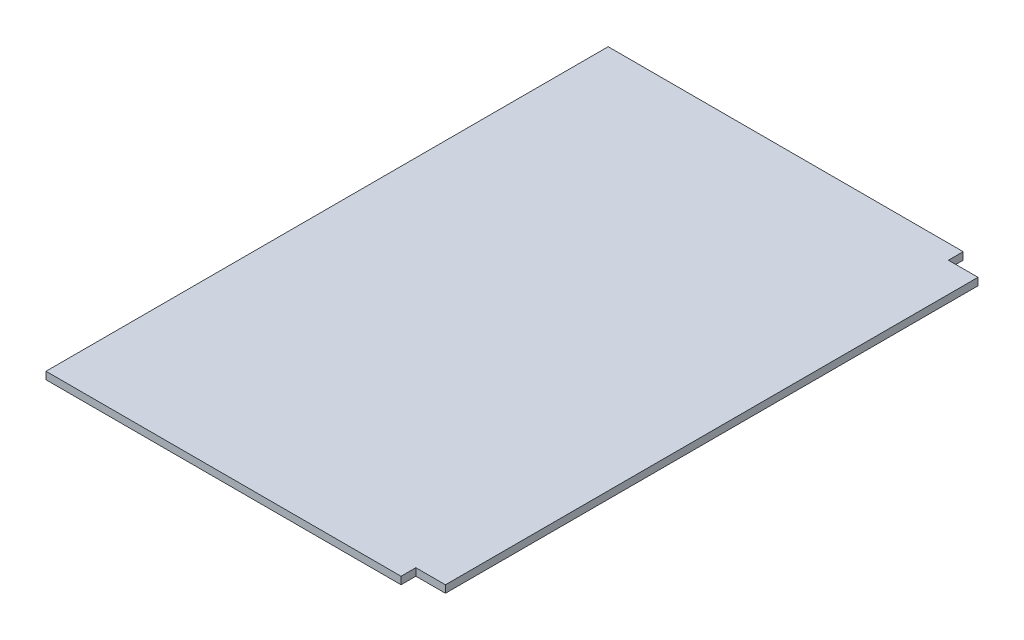
ISO-10303-21;
HEADER;
FILE_DESCRIPTION(('STEP AP214'),'2;1');
FILE_NAME('part.step','',(''),(''),'','','');
FILE_SCHEMA(('AUTOMOTIVE_DESIGN { 1 0 10303 214 1 1 1 1 }'));
ENDSEC;
DATA;
#1=APPLICATION_CONTEXT('core data for automotive mechanical design processes');
#2=APPLICATION_PROTOCOL_DEFINITION('international standard','automotive_design',2000,#1);
#3=PRODUCT_CONTEXT('',#1,'mechanical');
#4=PRODUCT('Part','Part','',(#3));
#5=PRODUCT_RELATED_PRODUCT_CATEGORY('part','',(#4));
#6=PRODUCT_DEFINITION_FORMATION('','',#4);
#7=PRODUCT_DEFINITION_CONTEXT('part definition',#1,'design');
#8=PRODUCT_DEFINITION('design','',#6,#7);
#9=PRODUCT_DEFINITION_SHAPE('','',#8);
#10=(LENGTH_UNIT() NAMED_UNIT(*) SI_UNIT(.MILLI.,.METRE.));
#11=(NAMED_UNIT(*) PLANE_ANGLE_UNIT() SI_UNIT($,.RADIAN.));
#12=(NAMED_UNIT(*) SI_UNIT($,.STERADIAN.) SOLID_ANGLE_UNIT());
#13=UNCERTAINTY_MEASURE_WITH_UNIT(LENGTH_MEASURE(1.E-05),#10,'distance_accuracy_value','');
#14=(GEOMETRIC_REPRESENTATION_CONTEXT(3) GLOBAL_UNCERTAINTY_ASSIGNED_CONTEXT((#13)) GLOBAL_UNIT_ASSIGNED_CONTEXT((#10,
#11,#12)) REPRESENTATION_CONTEXT('',''));
#15=CARTESIAN_POINT('',(0.,0.,0.));
#16=DIRECTION('',(0.,0.,1.));
#17=DIRECTION('',(1.,0.,0.));
#18=AXIS2_PLACEMENT_3D('',#15,#16,#17);
#19=CARTESIAN_POINT('',(-457.2,-12.7,609.6));
#20=DIRECTION('',(0.,0.,1.));
#21=DIRECTION('',(1.,0.,0.));
#22=AXIS2_PLACEMENT_3D('',#19,#20,#21);
#23=PLANE('',#22);
#24=DIRECTION('',(0.,1.,0.));
#25=VECTOR('',#24,1.);
#26=CARTESIAN_POINT('',(152.4,-69.4961266284947,609.6));
#27=LINE('',#26,#25);
#28=CARTESIAN_POINT('',(152.4,-12.7,609.6));
#29=VERTEX_POINT('',#28);
#30=CARTESIAN_POINT('',(152.4,0.,609.6));
#31=VERTEX_POINT('',#30);
#32=EDGE_CURVE('E148',#29,#31,#27,.T.);
#33=ORIENTED_EDGE('',*,*,#32,.T.);
#34=DIRECTION('',(1.,0.,0.));
#35=VECTOR('',#34,1.);
#36=CARTESIAN_POINT('',(-457.2,0.,609.6));
#37=LINE('',#36,#35);
#38=CARTESIAN_POINT('',(-457.2,0.,609.6));
#39=VERTEX_POINT('',#38);
#40=EDGE_CURVE('E135',#39,#31,#37,.T.);
#41=ORIENTED_EDGE('',*,*,#40,.F.);
#42=DIRECTION('',(0.,1.,0.));
#43=VECTOR('',#42,1.);
#44=CARTESIAN_POINT('',(-457.2,-12.7,609.6));
#45=LINE('',#44,#43);
#46=CARTESIAN_POINT('',(-457.2,-12.7,609.6));
#47=VERTEX_POINT('',#46);
#48=EDGE_CURVE('E11',#47,#39,#45,.T.);
#49=ORIENTED_EDGE('',*,*,#48,.F.);
#50=DIRECTION('',(1.,0.,0.));
#51=VECTOR('',#50,1.);
#52=CARTESIAN_POINT('',(-457.2,-12.7,609.6));
#53=LINE('',#52,#51);
#54=EDGE_CURVE('E42',#47,#29,#53,.T.);
#55=ORIENTED_EDGE('',*,*,#54,.T.);
#56=EDGE_LOOP('',(#33,#41,#49,#55));
#57=FACE_BOUND('',#56,.T.);
#58=ADVANCED_FACE('F34',(#57),#23,.T.);
#59=CARTESIAN_POINT('',(0.,-12.7,0.));
#60=DIRECTION('',(0.,1.,0.));
#61=DIRECTION('',(0.,0.,1.));
#62=AXIS2_PLACEMENT_3D('',#59,#60,#61);
#63=PLANE('',#62);
#64=DIRECTION('',(0.,0.,-1.));
#65=VECTOR('',#64,1.);
#66=CARTESIAN_POINT('',(152.4,-12.7,-355.6));
#67=LINE('',#66,#65);
#68=CARTESIAN_POINT('',(152.4,-12.7,-330.2));
#69=VERTEX_POINT('',#68);
#70=CARTESIAN_POINT('',(152.4,-12.6999999999999,-355.6));
#71=VERTEX_POINT('',#70);
#72=EDGE_CURVE('E57',#69,#71,#67,.T.);
#73=ORIENTED_EDGE('',*,*,#72,.F.);
#74=DIRECTION('',(-1.,0.,0.));
#75=VECTOR('',#74,1.);
#76=CARTESIAN_POINT('',(203.2,-12.7,-330.2));
#77=LINE('',#76,#75);
#78=CARTESIAN_POINT('',(203.2,-12.7,-330.2));
#79=VERTEX_POINT('',#78);
#80=EDGE_CURVE('E121',#79,#69,#77,.T.);
#81=ORIENTED_EDGE('',*,*,#80,.F.);
#82=DIRECTION('',(0.,0.,1.));
#83=VECTOR('',#82,1.);
#84=CARTESIAN_POINT('',(203.2,-12.6999999999999,0.));
#85=LINE('',#84,#83);
#86=CARTESIAN_POINT('',(203.2,-12.6999999999999,584.2));
#87=VERTEX_POINT('',#86);
#88=EDGE_CURVE('E130',#79,#87,#85,.T.);
#89=ORIENTED_EDGE('',*,*,#88,.T.);
#90=DIRECTION('',(1.,0.,0.));
#91=VECTOR('',#90,1.);
#92=CARTESIAN_POINT('',(203.2,-12.7,584.2));
#93=LINE('',#92,#91);
#94=CARTESIAN_POINT('',(152.4,-12.7,584.2));
#95=VERTEX_POINT('',#94);
#96=EDGE_CURVE('E49',#95,#87,#93,.T.);
#97=ORIENTED_EDGE('',*,*,#96,.F.);
#98=DIRECTION('',(0.,0.,-1.));
#99=VECTOR('',#98,1.);
#100=CARTESIAN_POINT('',(152.4,-12.7,609.6));
#101=LINE('',#100,#99);
#102=EDGE_CURVE('E151',#29,#95,#101,.T.);
#103=ORIENTED_EDGE('',*,*,#102,.F.);
#104=ORIENTED_EDGE('',*,*,#54,.F.);
#105=DIRECTION('',(0.,0.,1.));
#106=VECTOR('',#105,1.);
#107=CARTESIAN_POINT('',(-457.2,-12.7,-609.6));
#108=LINE('',#107,#106);
#109=CARTESIAN_POINT('',(-457.2,-12.6999999999999,-355.6));
#110=VERTEX_POINT('',#109);
#111=EDGE_CURVE('E133',#110,#47,#108,.T.);
#112=ORIENTED_EDGE('',*,*,#111,.F.);
#113=DIRECTION('',(-1.,0.,0.));
#114=VECTOR('',#113,1.);
#115=CARTESIAN_POINT('',(0.,-12.6999999999999,-355.6));
#116=LINE('',#115,#114);
#117=EDGE_CURVE('E126',#71,#110,#116,.T.);
#118=ORIENTED_EDGE('',*,*,#117,.F.);
#119=EDGE_LOOP('',(#73,#81,#89,#97,#103,#104,#112,#118));
#120=FACE_BOUND('',#119,.T.);
#121=ADVANCED_FACE('F176',(#120),#63,.F.);
#122=CARTESIAN_POINT('',(0.,0.,0.));
#123=DIRECTION('',(0.,1.,0.));
#124=DIRECTION('',(0.,0.,1.));
#125=AXIS2_PLACEMENT_3D('',#122,#123,#124);
#126=PLANE('',#125);
#127=DIRECTION('',(1.,0.,0.));
#128=VECTOR('',#127,1.);
#129=CARTESIAN_POINT('',(203.2,0.,-330.2));
#130=LINE('',#129,#128);
#131=CARTESIAN_POINT('',(152.4,0.,-330.2));
#132=VERTEX_POINT('',#131);
#133=CARTESIAN_POINT('',(203.2,0.,-330.2));
#134=VERTEX_POINT('',#133);
#135=EDGE_CURVE('E108',#132,#134,#130,.T.);
#136=ORIENTED_EDGE('',*,*,#135,.F.);
#137=DIRECTION('',(0.,0.,1.));
#138=VECTOR('',#137,1.);
#139=CARTESIAN_POINT('',(152.4,0.,-355.6));
#140=LINE('',#139,#138);
#141=CARTESIAN_POINT('',(152.4,0.,-355.6));
#142=VERTEX_POINT('',#141);
#143=EDGE_CURVE('E102',#142,#132,#140,.T.);
#144=ORIENTED_EDGE('',*,*,#143,.F.);
#145=DIRECTION('',(1.,0.,0.));
#146=VECTOR('',#145,1.);
#147=CARTESIAN_POINT('',(0.,0.,-355.6));
#148=LINE('',#147,#146);
#149=CARTESIAN_POINT('',(-457.2,0.,-355.6));
#150=VERTEX_POINT('',#149);
#151=EDGE_CURVE('E113',#150,#142,#148,.T.);
#152=ORIENTED_EDGE('',*,*,#151,.F.);
#153=DIRECTION('',(0.,0.,1.));
#154=VECTOR('',#153,1.);
#155=CARTESIAN_POINT('',(-457.2,0.,-609.6));
#156=LINE('',#155,#154);
#157=EDGE_CURVE('E138',#150,#39,#156,.T.);
#158=ORIENTED_EDGE('',*,*,#157,.T.);
#159=ORIENTED_EDGE('',*,*,#40,.T.);
#160=DIRECTION('',(0.,0.,1.));
#161=VECTOR('',#160,1.);
#162=CARTESIAN_POINT('',(152.4,0.,609.6));
#163=LINE('',#162,#161);
#164=CARTESIAN_POINT('',(152.4,0.,584.2));
#165=VERTEX_POINT('',#164);
#166=EDGE_CURVE('E143',#165,#31,#163,.T.);
#167=ORIENTED_EDGE('',*,*,#166,.F.);
#168=DIRECTION('',(-1.,0.,0.));
#169=VECTOR('',#168,1.);
#170=CARTESIAN_POINT('',(203.2,0.,584.2));
#171=LINE('',#170,#169);
#172=CARTESIAN_POINT('',(203.2,0.,584.2));
#173=VERTEX_POINT('',#172);
#174=EDGE_CURVE('E161',#173,#165,#171,.T.);
#175=ORIENTED_EDGE('',*,*,#174,.F.);
#176=DIRECTION('',(0.,0.,-1.));
#177=VECTOR('',#176,1.);
#178=CARTESIAN_POINT('',(203.2,0.,0.));
#179=LINE('',#178,#177);
#180=EDGE_CURVE('E120',#173,#134,#179,.T.);
#181=ORIENTED_EDGE('',*,*,#180,.T.);
#182=EDGE_LOOP('',(#136,#144,#152,#158,#159,#167,#175,#181));
#183=FACE_BOUND('',#182,.T.);
#184=ADVANCED_FACE('F112',(#183),#126,.T.);
#185=CARTESIAN_POINT('',(-457.2,-12.7,-609.6));
#186=DIRECTION('',(-1.,0.,0.));
#187=DIRECTION('',(0.,0.,1.));
#188=AXIS2_PLACEMENT_3D('',#185,#186,#187);
#189=PLANE('',#188);
#190=DIRECTION('',(0.,1.,0.));
#191=VECTOR('',#190,1.);
#192=CARTESIAN_POINT('',(-457.2,-1536.7,-355.6));
#193=LINE('',#192,#191);
#194=EDGE_CURVE('E119',#110,#150,#193,.T.);
#195=ORIENTED_EDGE('',*,*,#194,.F.);
#196=ORIENTED_EDGE('',*,*,#111,.T.);
#197=ORIENTED_EDGE('',*,*,#48,.T.);
#198=ORIENTED_EDGE('',*,*,#157,.F.);
#199=EDGE_LOOP('',(#195,#196,#197,#198));
#200=FACE_BOUND('',#199,.T.);
#201=ADVANCED_FACE('F36',(#200),#189,.T.);
#202=CARTESIAN_POINT('',(203.2,-1536.7,0.));
#203=DIRECTION('',(1.,0.,0.));
#204=DIRECTION('',(0.,0.,-1.));
#205=AXIS2_PLACEMENT_3D('',#202,#203,#204);
#206=PLANE('',#205);
#207=DIRECTION('',(0.,1.,0.));
#208=VECTOR('',#207,1.);
#209=CARTESIAN_POINT('',(203.2,-69.4961266284947,-330.2));
#210=LINE('',#209,#208);
#211=EDGE_CURVE('E164',#79,#134,#210,.T.);
#212=ORIENTED_EDGE('',*,*,#211,.T.);
#213=ORIENTED_EDGE('',*,*,#180,.F.);
#214=DIRECTION('',(0.,1.,0.));
#215=VECTOR('',#214,1.);
#216=CARTESIAN_POINT('',(203.2,-69.4961266284947,584.2));
#217=LINE('',#216,#215);
#218=EDGE_CURVE('E155',#87,#173,#217,.T.);
#219=ORIENTED_EDGE('',*,*,#218,.F.);
#220=ORIENTED_EDGE('',*,*,#88,.F.);
#221=EDGE_LOOP('',(#212,#213,#219,#220));
#222=FACE_BOUND('',#221,.T.);
#223=ADVANCED_FACE('F174',(#222),#206,.T.);
#224=CARTESIAN_POINT('',(0.,-1536.7,-355.6));
#225=DIRECTION('',(0.,0.,1.));
#226=DIRECTION('',(1.,0.,0.));
#227=AXIS2_PLACEMENT_3D('',#224,#225,#226);
#228=PLANE('',#227);
#229=ORIENTED_EDGE('',*,*,#151,.T.);
#230=DIRECTION('',(0.,1.,0.));
#231=VECTOR('',#230,1.);
#232=CARTESIAN_POINT('',(152.4,-69.4961266284947,-355.6));
#233=LINE('',#232,#231);
#234=EDGE_CURVE('E99',#71,#142,#233,.T.);
#235=ORIENTED_EDGE('',*,*,#234,.F.);
#236=ORIENTED_EDGE('',*,*,#117,.T.);
#237=ORIENTED_EDGE('',*,*,#194,.T.);
#238=EDGE_LOOP('',(#229,#235,#236,#237));
#239=FACE_BOUND('',#238,.T.);
#240=ADVANCED_FACE('F117',(#239),#228,.F.);
#241=CARTESIAN_POINT('',(203.2,-69.4961266284947,-330.2));
#242=DIRECTION('',(0.,0.,1.));
#243=DIRECTION('',(1.,0.,0.));
#244=AXIS2_PLACEMENT_3D('',#241,#242,#243);
#245=PLANE('',#244);
#246=ORIENTED_EDGE('',*,*,#80,.T.);
#247=DIRECTION('',(0.,1.,0.));
#248=VECTOR('',#247,1.);
#249=CARTESIAN_POINT('',(152.4,-69.4961266284947,-330.2));
#250=LINE('',#249,#248);
#251=EDGE_CURVE('E107',#69,#132,#250,.T.);
#252=ORIENTED_EDGE('',*,*,#251,.T.);
#253=ORIENTED_EDGE('',*,*,#135,.T.);
#254=ORIENTED_EDGE('',*,*,#211,.F.);
#255=EDGE_LOOP('',(#246,#252,#253,#254));
#256=FACE_BOUND('',#255,.T.);
#257=ADVANCED_FACE('F169',(#256),#245,.F.);
#258=CARTESIAN_POINT('',(152.4,-69.4961266284947,-355.6));
#259=DIRECTION('',(-1.,0.,0.));
#260=DIRECTION('',(0.,0.,1.));
#261=AXIS2_PLACEMENT_3D('',#258,#259,#260);
#262=PLANE('',#261);
#263=ORIENTED_EDGE('',*,*,#72,.T.);
#264=ORIENTED_EDGE('',*,*,#234,.T.);
#265=ORIENTED_EDGE('',*,*,#143,.T.);
#266=ORIENTED_EDGE('',*,*,#251,.F.);
#267=EDGE_LOOP('',(#263,#264,#265,#266));
#268=FACE_BOUND('',#267,.T.);
#269=ADVANCED_FACE('F101',(#268),#262,.F.);
#270=CARTESIAN_POINT('',(152.4,-69.4961266284947,609.6));
#271=DIRECTION('',(-1.,0.,0.));
#272=DIRECTION('',(0.,0.,1.));
#273=AXIS2_PLACEMENT_3D('',#270,#271,#272);
#274=PLANE('',#273);
#275=ORIENTED_EDGE('',*,*,#102,.T.);
#276=DIRECTION('',(0.,1.,0.));
#277=VECTOR('',#276,1.);
#278=CARTESIAN_POINT('',(152.4,-69.4961266284947,584.2));
#279=LINE('',#278,#277);
#280=EDGE_CURVE('E152',#95,#165,#279,.T.);
#281=ORIENTED_EDGE('',*,*,#280,.T.);
#282=ORIENTED_EDGE('',*,*,#166,.T.);
#283=ORIENTED_EDGE('',*,*,#32,.F.);
#284=EDGE_LOOP('',(#275,#281,#282,#283));
#285=FACE_BOUND('',#284,.T.);
#286=ADVANCED_FACE('F197',(#285),#274,.F.);
#287=CARTESIAN_POINT('',(203.2,-69.4961266284947,584.2));
#288=DIRECTION('',(0.,0.,-1.));
#289=DIRECTION('',(-1.,0.,0.));
#290=AXIS2_PLACEMENT_3D('',#287,#288,#289);
#291=PLANE('',#290);
#292=ORIENTED_EDGE('',*,*,#96,.T.);
#293=ORIENTED_EDGE('',*,*,#218,.T.);
#294=ORIENTED_EDGE('',*,*,#174,.T.);
#295=ORIENTED_EDGE('',*,*,#280,.F.);
#296=EDGE_LOOP('',(#292,#293,#294,#295));
#297=FACE_BOUND('',#296,.T.);
#298=ADVANCED_FACE('F194',(#297),#291,.F.);
#299=CLOSED_SHELL('',(#58,#121,#184,#201,#223,#240,#257,#269,#286,#298));
#300=MANIFOLD_SOLID_BREP('B2',#299);
#301=ADVANCED_BREP_SHAPE_REPRESENTATION('',(#18,#300),#14);
#302=SHAPE_DEFINITION_REPRESENTATION(#9,#301);
ENDSEC;
END-ISO-10303-21;
